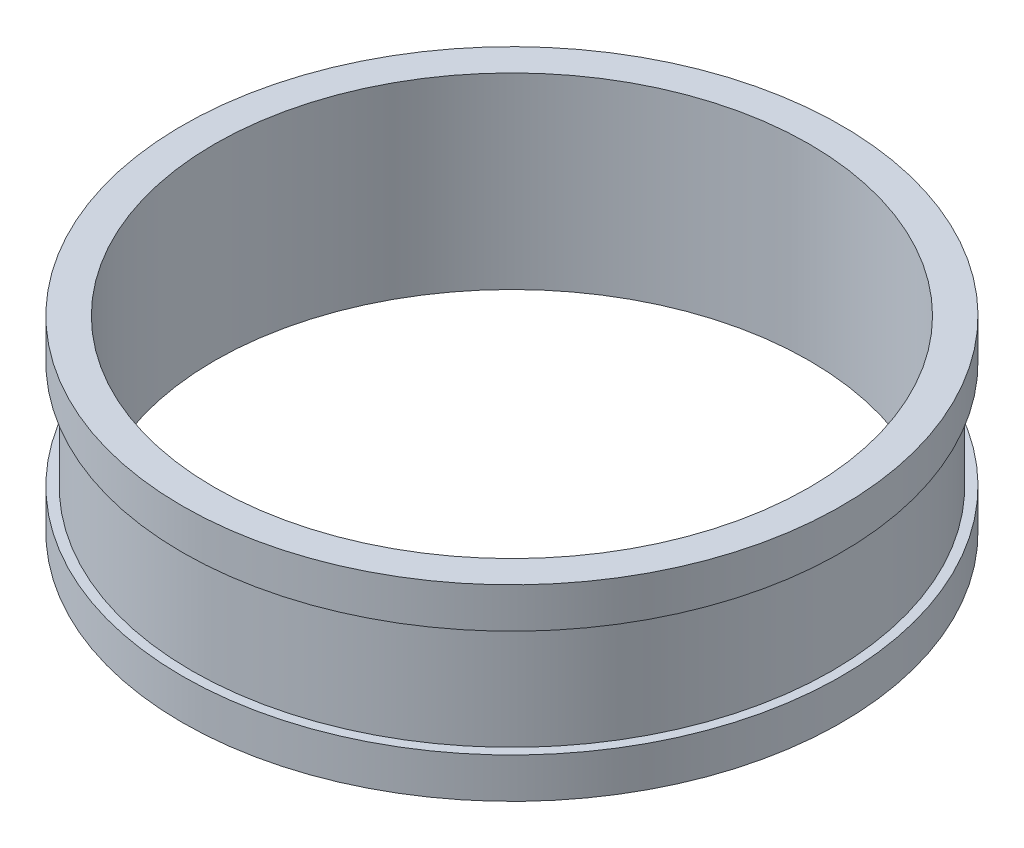
ISO-10303-21;
HEADER;
FILE_DESCRIPTION(('STEP AP214'),'2;1');
FILE_NAME('part.step','',(''),(''),'','','');
FILE_SCHEMA(('AUTOMOTIVE_DESIGN { 1 0 10303 214 1 1 1 1 }'));
ENDSEC;
DATA;
#1=APPLICATION_CONTEXT('core data for automotive mechanical design processes');
#2=APPLICATION_PROTOCOL_DEFINITION('international standard','automotive_design',2000,#1);
#3=PRODUCT_CONTEXT('',#1,'mechanical');
#4=PRODUCT('Part','Part','',(#3));
#5=PRODUCT_RELATED_PRODUCT_CATEGORY('part','',(#4));
#6=PRODUCT_DEFINITION_FORMATION('','',#4);
#7=PRODUCT_DEFINITION_CONTEXT('part definition',#1,'design');
#8=PRODUCT_DEFINITION('design','',#6,#7);
#9=PRODUCT_DEFINITION_SHAPE('','',#8);
#10=(LENGTH_UNIT() NAMED_UNIT(*) SI_UNIT(.MILLI.,.METRE.));
#11=(NAMED_UNIT(*) PLANE_ANGLE_UNIT() SI_UNIT($,.RADIAN.));
#12=(NAMED_UNIT(*) SI_UNIT($,.STERADIAN.) SOLID_ANGLE_UNIT());
#13=UNCERTAINTY_MEASURE_WITH_UNIT(LENGTH_MEASURE(1.E-05),#10,'distance_accuracy_value','');
#14=(GEOMETRIC_REPRESENTATION_CONTEXT(3) GLOBAL_UNCERTAINTY_ASSIGNED_CONTEXT((#13)) GLOBAL_UNIT_ASSIGNED_CONTEXT((#10,
#11,#12)) REPRESENTATION_CONTEXT('',''));
#15=CARTESIAN_POINT('',(0.,0.,0.));
#16=DIRECTION('',(0.,0.,1.));
#17=DIRECTION('',(1.,0.,0.));
#18=AXIS2_PLACEMENT_3D('',#15,#16,#17);
#19=CARTESIAN_POINT('',(0.,7.,0.));
#20=DIRECTION('',(0.,-1.,0.));
#21=DIRECTION('',(0.,0.,-1.));
#22=AXIS2_PLACEMENT_3D('',#19,#20,#21);
#23=CYLINDRICAL_SURFACE('',#22,12.3);
#24=CARTESIAN_POINT('',(0.,1.5,0.));
#25=DIRECTION('',(0.,1.,0.));
#26=DIRECTION('',(0.,0.,1.));
#27=AXIS2_PLACEMENT_3D('',#24,#25,#26);
#28=CIRCLE('',#27,12.3);
#29=CARTESIAN_POINT('',(0.,1.5,12.3));
#30=VERTEX_POINT('',#29);
#31=EDGE_CURVE('E56',#30,#30,#28,.T.);
#32=ORIENTED_EDGE('',*,*,#31,.F.);
#33=EDGE_LOOP('',(#32));
#34=FACE_BOUND('',#33,.T.);
#35=CARTESIAN_POINT('',(0.,0.,0.));
#36=DIRECTION('',(0.,1.,0.));
#37=DIRECTION('',(0.,0.,1.));
#38=AXIS2_PLACEMENT_3D('',#35,#36,#37);
#39=CIRCLE('',#38,12.3);
#40=CARTESIAN_POINT('',(0.,0.,12.3));
#41=VERTEX_POINT('',#40);
#42=EDGE_CURVE('E41',#41,#41,#39,.T.);
#43=ORIENTED_EDGE('',*,*,#42,.T.);
#44=EDGE_LOOP('',(#43));
#45=FACE_BOUND('',#44,.T.);
#46=ADVANCED_FACE('F37',(#34,#45),#23,.T.);
#47=CARTESIAN_POINT('',(0.,7.,0.));
#48=DIRECTION('',(0.,1.,0.));
#49=DIRECTION('',(0.,0.,1.));
#50=AXIS2_PLACEMENT_3D('',#47,#48,#49);
#51=PLANE('',#50);
#52=CARTESIAN_POINT('',(0.,7.,0.));
#53=DIRECTION('',(0.,1.,0.));
#54=DIRECTION('',(0.,0.,1.));
#55=AXIS2_PLACEMENT_3D('',#52,#53,#54);
#56=CIRCLE('',#55,12.3);
#57=CARTESIAN_POINT('',(0.,7.,12.3));
#58=VERTEX_POINT('',#57);
#59=EDGE_CURVE('E10',#58,#58,#56,.T.);
#60=ORIENTED_EDGE('',*,*,#59,.T.);
#61=EDGE_LOOP('',(#60));
#62=FACE_BOUND('',#61,.T.);
#63=CARTESIAN_POINT('',(0.,7.,0.));
#64=DIRECTION('',(0.,1.,0.));
#65=DIRECTION('',(0.,0.,1.));
#66=AXIS2_PLACEMENT_3D('',#63,#64,#65);
#67=CIRCLE('',#66,11.1);
#68=CARTESIAN_POINT('',(0.,7.,11.1));
#69=VERTEX_POINT('',#68);
#70=EDGE_CURVE('E50',#69,#69,#67,.T.);
#71=ORIENTED_EDGE('',*,*,#70,.F.);
#72=EDGE_LOOP('',(#71));
#73=FACE_BOUND('',#72,.T.);
#74=ADVANCED_FACE('F99',(#62,#73),#51,.T.);
#75=CARTESIAN_POINT('',(0.,0.,0.));
#76=DIRECTION('',(0.,1.,0.));
#77=DIRECTION('',(0.,0.,1.));
#78=AXIS2_PLACEMENT_3D('',#75,#76,#77);
#79=PLANE('',#78);
#80=ORIENTED_EDGE('',*,*,#42,.F.);
#81=EDGE_LOOP('',(#80));
#82=FACE_BOUND('',#81,.T.);
#83=CARTESIAN_POINT('',(0.,0.,0.));
#84=DIRECTION('',(0.,1.,0.));
#85=DIRECTION('',(0.,0.,1.));
#86=AXIS2_PLACEMENT_3D('',#83,#84,#85);
#87=CIRCLE('',#86,11.1);
#88=CARTESIAN_POINT('',(0.,0.,11.1));
#89=VERTEX_POINT('',#88);
#90=EDGE_CURVE('E52',#89,#89,#87,.T.);
#91=ORIENTED_EDGE('',*,*,#90,.T.);
#92=EDGE_LOOP('',(#91));
#93=FACE_BOUND('',#92,.T.);
#94=ADVANCED_FACE('F102',(#82,#93),#79,.F.);
#95=CARTESIAN_POINT('',(0.,5.5,0.));
#96=DIRECTION('',(0.,1.,0.));
#97=DIRECTION('',(0.,0.,1.));
#98=AXIS2_PLACEMENT_3D('',#95,#96,#97);
#99=CIRCLE('',#98,12.3);
#100=CARTESIAN_POINT('',(0.,5.5,12.3));
#101=VERTEX_POINT('',#100);
#102=EDGE_CURVE('E71',#101,#101,#99,.T.);
#103=ORIENTED_EDGE('',*,*,#102,.T.);
#104=EDGE_LOOP('',(#103));
#105=FACE_BOUND('',#104,.T.);
#106=ORIENTED_EDGE('',*,*,#59,.F.);
#107=EDGE_LOOP('',(#106));
#108=FACE_BOUND('',#107,.T.);
#109=ADVANCED_FACE('F39',(#105,#108),#23,.T.);
#110=CARTESIAN_POINT('',(0.,7.,0.));
#111=DIRECTION('',(0.,-1.,0.));
#112=DIRECTION('',(0.,0.,-1.));
#113=AXIS2_PLACEMENT_3D('',#110,#111,#112);
#114=CYLINDRICAL_SURFACE('',#113,11.1);
#115=ORIENTED_EDGE('',*,*,#70,.T.);
#116=EDGE_LOOP('',(#115));
#117=FACE_BOUND('',#116,.T.);
#118=ORIENTED_EDGE('',*,*,#90,.F.);
#119=EDGE_LOOP('',(#118));
#120=FACE_BOUND('',#119,.T.);
#121=ADVANCED_FACE('F93',(#117,#120),#114,.F.);
#122=CARTESIAN_POINT('',(-12.3,1.5,0.));
#123=DIRECTION('',(0.,-1.,0.));
#124=DIRECTION('',(0.,0.,-1.));
#125=AXIS2_PLACEMENT_3D('',#122,#123,#124);
#126=PLANE('',#125);
#127=CARTESIAN_POINT('',(0.,1.5,0.));
#128=DIRECTION('',(0.,1.,0.));
#129=DIRECTION('',(0.,0.,1.));
#130=AXIS2_PLACEMENT_3D('',#127,#128,#129);
#131=CIRCLE('',#130,11.95);
#132=CARTESIAN_POINT('',(0.,1.5,11.95));
#133=VERTEX_POINT('',#132);
#134=EDGE_CURVE('E63',#133,#133,#131,.T.);
#135=ORIENTED_EDGE('',*,*,#134,.F.);
#136=EDGE_LOOP('',(#135));
#137=FACE_BOUND('',#136,.T.);
#138=ORIENTED_EDGE('',*,*,#31,.T.);
#139=EDGE_LOOP('',(#138));
#140=FACE_BOUND('',#139,.T.);
#141=ADVANCED_FACE('F87',(#137,#140),#126,.F.);
#142=CARTESIAN_POINT('',(0.,7.,0.));
#143=DIRECTION('',(0.,1.,0.));
#144=DIRECTION('',(0.,0.,1.));
#145=AXIS2_PLACEMENT_3D('',#142,#143,#144);
#146=CYLINDRICAL_SURFACE('',#145,11.95);
#147=CARTESIAN_POINT('',(0.,5.5,0.));
#148=DIRECTION('',(0.,1.,0.));
#149=DIRECTION('',(0.,0.,1.));
#150=AXIS2_PLACEMENT_3D('',#147,#148,#149);
#151=CIRCLE('',#150,11.95);
#152=CARTESIAN_POINT('',(0.,5.5,11.95));
#153=VERTEX_POINT('',#152);
#154=EDGE_CURVE('E67',#153,#153,#151,.T.);
#155=ORIENTED_EDGE('',*,*,#154,.F.);
#156=EDGE_LOOP('',(#155));
#157=FACE_BOUND('',#156,.T.);
#158=ORIENTED_EDGE('',*,*,#134,.T.);
#159=EDGE_LOOP('',(#158));
#160=FACE_BOUND('',#159,.T.);
#161=ADVANCED_FACE('F81',(#157,#160),#146,.T.);
#162=CARTESIAN_POINT('',(-12.3,5.5,0.));
#163=DIRECTION('',(0.,1.,0.));
#164=DIRECTION('',(0.,0.,1.));
#165=AXIS2_PLACEMENT_3D('',#162,#163,#164);
#166=PLANE('',#165);
#167=ORIENTED_EDGE('',*,*,#102,.F.);
#168=EDGE_LOOP('',(#167));
#169=FACE_BOUND('',#168,.T.);
#170=ORIENTED_EDGE('',*,*,#154,.T.);
#171=EDGE_LOOP('',(#170));
#172=FACE_BOUND('',#171,.T.);
#173=ADVANCED_FACE('F78',(#169,#172),#166,.F.);
#174=CLOSED_SHELL('',(#46,#74,#94,#109,#121,#141,#161,#173));
#175=MANIFOLD_SOLID_BREP('B2',#174);
#176=ADVANCED_BREP_SHAPE_REPRESENTATION('',(#18,#175),#14);
#177=SHAPE_DEFINITION_REPRESENTATION(#9,#176);
ENDSEC;
END-ISO-10303-21;
